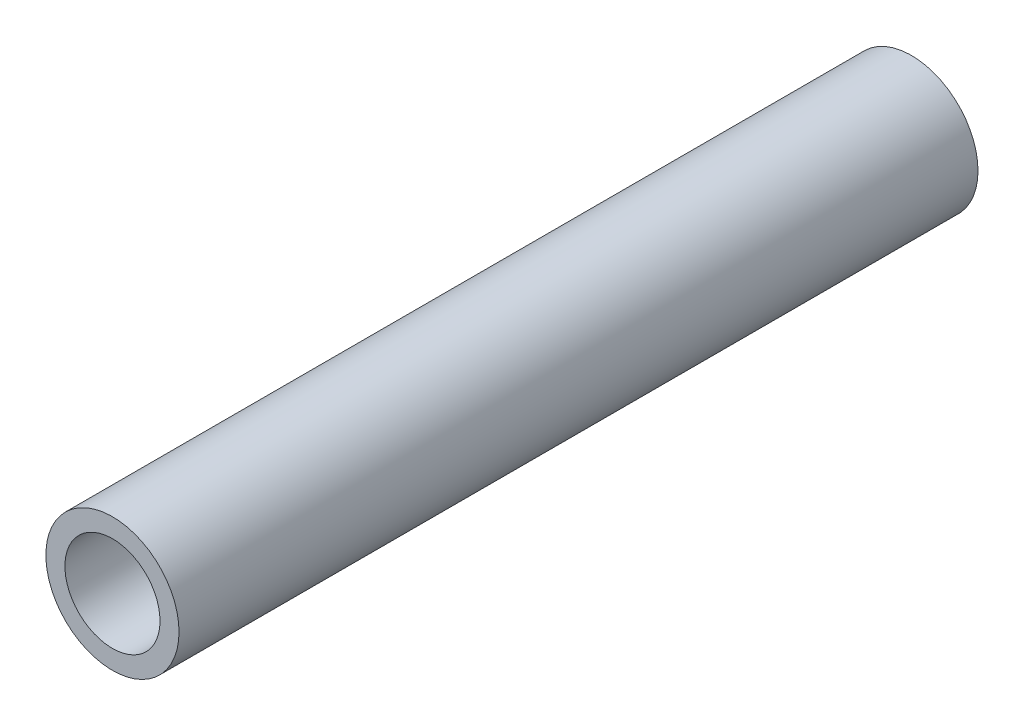
ISO-10303-21;
HEADER;
FILE_DESCRIPTION(('STEP AP214'),'2;1');
FILE_NAME('part.step','',(''),(''),'','','');
FILE_SCHEMA(('AUTOMOTIVE_DESIGN { 1 0 10303 214 1 1 1 1 }'));
ENDSEC;
DATA;
#1=APPLICATION_CONTEXT('core data for automotive mechanical design processes');
#2=APPLICATION_PROTOCOL_DEFINITION('international standard','automotive_design',2000,#1);
#3=PRODUCT_CONTEXT('',#1,'mechanical');
#4=PRODUCT('Part','Part','',(#3));
#5=PRODUCT_RELATED_PRODUCT_CATEGORY('part','',(#4));
#6=PRODUCT_DEFINITION_FORMATION('','',#4);
#7=PRODUCT_DEFINITION_CONTEXT('part definition',#1,'design');
#8=PRODUCT_DEFINITION('design','',#6,#7);
#9=PRODUCT_DEFINITION_SHAPE('','',#8);
#10=(LENGTH_UNIT() NAMED_UNIT(*) SI_UNIT(.MILLI.,.METRE.));
#11=(NAMED_UNIT(*) PLANE_ANGLE_UNIT() SI_UNIT($,.RADIAN.));
#12=(NAMED_UNIT(*) SI_UNIT($,.STERADIAN.) SOLID_ANGLE_UNIT());
#13=UNCERTAINTY_MEASURE_WITH_UNIT(LENGTH_MEASURE(1.E-05),#10,'distance_accuracy_value','');
#14=(GEOMETRIC_REPRESENTATION_CONTEXT(3) GLOBAL_UNCERTAINTY_ASSIGNED_CONTEXT((#13)) GLOBAL_UNIT_ASSIGNED_CONTEXT((#10,
#11,#12)) REPRESENTATION_CONTEXT('',''));
#15=CARTESIAN_POINT('',(0.,0.,0.));
#16=DIRECTION('',(0.,0.,1.));
#17=DIRECTION('',(1.,0.,0.));
#18=AXIS2_PLACEMENT_3D('',#15,#16,#17);
#19=CARTESIAN_POINT('',(0.,0.,42.));
#20=DIRECTION('',(0.,0.,1.));
#21=DIRECTION('',(1.,0.,0.));
#22=AXIS2_PLACEMENT_3D('',#19,#20,#21);
#23=PLANE('',#22);
#24=CARTESIAN_POINT('',(0.,0.,42.));
#25=DIRECTION('',(0.,0.,1.));
#26=DIRECTION('',(1.,0.,0.));
#27=AXIS2_PLACEMENT_3D('',#24,#25,#26);
#28=CIRCLE('',#27,3.5);
#29=CARTESIAN_POINT('',(3.5,0.,42.));
#30=VERTEX_POINT('',#29);
#31=EDGE_CURVE('E10',#30,#30,#28,.T.);
#32=ORIENTED_EDGE('',*,*,#31,.T.);
#33=EDGE_LOOP('',(#32));
#34=FACE_BOUND('',#33,.T.);
#35=CARTESIAN_POINT('',(0.,0.,42.));
#36=DIRECTION('',(0.,0.,1.));
#37=DIRECTION('',(1.,0.,0.));
#38=AXIS2_PLACEMENT_3D('',#35,#36,#37);
#39=CIRCLE('',#38,2.5);
#40=CARTESIAN_POINT('',(2.5,0.,42.));
#41=VERTEX_POINT('',#40);
#42=EDGE_CURVE('E42',#41,#41,#39,.T.);
#43=ORIENTED_EDGE('',*,*,#42,.F.);
#44=EDGE_LOOP('',(#43));
#45=FACE_BOUND('',#44,.T.);
#46=ADVANCED_FACE('F31',(#34,#45),#23,.T.);
#47=CARTESIAN_POINT('',(0.,0.,0.));
#48=DIRECTION('',(0.,0.,1.));
#49=DIRECTION('',(1.,0.,0.));
#50=AXIS2_PLACEMENT_3D('',#47,#48,#49);
#51=PLANE('',#50);
#52=CARTESIAN_POINT('',(0.,0.,0.));
#53=DIRECTION('',(0.,0.,1.));
#54=DIRECTION('',(1.,0.,0.));
#55=AXIS2_PLACEMENT_3D('',#52,#53,#54);
#56=CIRCLE('',#55,3.5);
#57=CARTESIAN_POINT('',(3.5,0.,0.));
#58=VERTEX_POINT('',#57);
#59=EDGE_CURVE('E35',#58,#58,#56,.T.);
#60=ORIENTED_EDGE('',*,*,#59,.F.);
#61=EDGE_LOOP('',(#60));
#62=FACE_BOUND('',#61,.T.);
#63=CARTESIAN_POINT('',(0.,0.,0.));
#64=DIRECTION('',(0.,0.,1.));
#65=DIRECTION('',(1.,0.,0.));
#66=AXIS2_PLACEMENT_3D('',#63,#64,#65);
#67=CIRCLE('',#66,2.5);
#68=CARTESIAN_POINT('',(2.5,0.,0.));
#69=VERTEX_POINT('',#68);
#70=EDGE_CURVE('E44',#69,#69,#67,.T.);
#71=ORIENTED_EDGE('',*,*,#70,.T.);
#72=EDGE_LOOP('',(#71));
#73=FACE_BOUND('',#72,.T.);
#74=ADVANCED_FACE('F54',(#62,#73),#51,.F.);
#75=CARTESIAN_POINT('',(0.,0.,42.));
#76=DIRECTION('',(0.,0.,-1.));
#77=DIRECTION('',(-1.,0.,0.));
#78=AXIS2_PLACEMENT_3D('',#75,#76,#77);
#79=CYLINDRICAL_SURFACE('',#78,3.5);
#80=ORIENTED_EDGE('',*,*,#31,.F.);
#81=EDGE_LOOP('',(#80));
#82=FACE_BOUND('',#81,.T.);
#83=ORIENTED_EDGE('',*,*,#59,.T.);
#84=EDGE_LOOP('',(#83));
#85=FACE_BOUND('',#84,.T.);
#86=ADVANCED_FACE('F33',(#82,#85),#79,.T.);
#87=CARTESIAN_POINT('',(0.,0.,42.));
#88=DIRECTION('',(0.,0.,-1.));
#89=DIRECTION('',(-1.,0.,0.));
#90=AXIS2_PLACEMENT_3D('',#87,#88,#89);
#91=CYLINDRICAL_SURFACE('',#90,2.5);
#92=ORIENTED_EDGE('',*,*,#42,.T.);
#93=EDGE_LOOP('',(#92));
#94=FACE_BOUND('',#93,.T.);
#95=ORIENTED_EDGE('',*,*,#70,.F.);
#96=EDGE_LOOP('',(#95));
#97=FACE_BOUND('',#96,.T.);
#98=ADVANCED_FACE('F50',(#94,#97),#91,.F.);
#99=CLOSED_SHELL('',(#46,#74,#86,#98));
#100=MANIFOLD_SOLID_BREP('B2',#99);
#101=ADVANCED_BREP_SHAPE_REPRESENTATION('',(#18,#100),#14);
#102=SHAPE_DEFINITION_REPRESENTATION(#9,#101);
ENDSEC;
END-ISO-10303-21;
